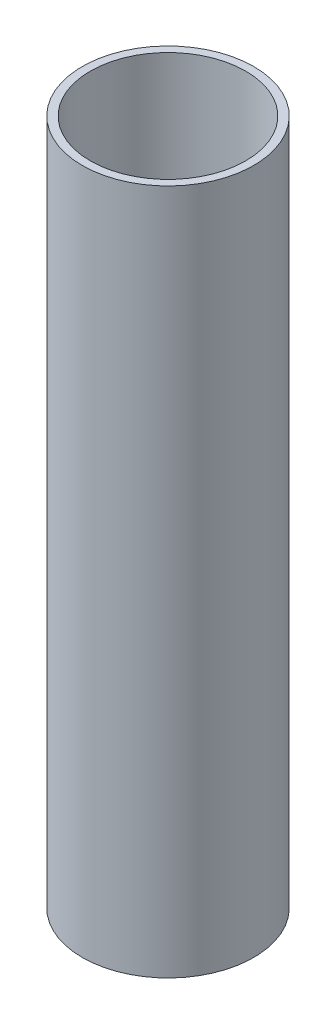
ISO-10303-21;
HEADER;
FILE_DESCRIPTION(('STEP AP214'),'2;1');
FILE_NAME('part.step','',(''),(''),'','','');
FILE_SCHEMA(('AUTOMOTIVE_DESIGN { 1 0 10303 214 1 1 1 1 }'));
ENDSEC;
DATA;
#1=APPLICATION_CONTEXT('core data for automotive mechanical design processes');
#2=APPLICATION_PROTOCOL_DEFINITION('international standard','automotive_design',2000,#1);
#3=PRODUCT_CONTEXT('',#1,'mechanical');
#4=PRODUCT('Part','Part','',(#3));
#5=PRODUCT_RELATED_PRODUCT_CATEGORY('part','',(#4));
#6=PRODUCT_DEFINITION_FORMATION('','',#4);
#7=PRODUCT_DEFINITION_CONTEXT('part definition',#1,'design');
#8=PRODUCT_DEFINITION('design','',#6,#7);
#9=PRODUCT_DEFINITION_SHAPE('','',#8);
#10=(LENGTH_UNIT() NAMED_UNIT(*) SI_UNIT(.MILLI.,.METRE.));
#11=(NAMED_UNIT(*) PLANE_ANGLE_UNIT() SI_UNIT($,.RADIAN.));
#12=(NAMED_UNIT(*) SI_UNIT($,.STERADIAN.) SOLID_ANGLE_UNIT());
#13=UNCERTAINTY_MEASURE_WITH_UNIT(LENGTH_MEASURE(1.E-05),#10,'distance_accuracy_value','');
#14=(GEOMETRIC_REPRESENTATION_CONTEXT(3) GLOBAL_UNCERTAINTY_ASSIGNED_CONTEXT((#13)) GLOBAL_UNIT_ASSIGNED_CONTEXT((#10,
#11,#12)) REPRESENTATION_CONTEXT('',''));
#15=CARTESIAN_POINT('',(0.,0.,0.));
#16=DIRECTION('',(0.,0.,1.));
#17=DIRECTION('',(1.,0.,0.));
#18=AXIS2_PLACEMENT_3D('',#15,#16,#17);
#19=CARTESIAN_POINT('',(0.,38.1,0.));
#20=DIRECTION('',(0.,1.,0.));
#21=DIRECTION('',(0.,0.,1.));
#22=AXIS2_PLACEMENT_3D('',#19,#20,#21);
#23=PLANE('',#22);
#24=CARTESIAN_POINT('',(0.,38.1,0.));
#25=DIRECTION('',(0.,1.,0.));
#26=DIRECTION('',(0.,0.,1.));
#27=AXIS2_PLACEMENT_3D('',#24,#25,#26);
#28=CIRCLE('',#27,9.525);
#29=CARTESIAN_POINT('',(0.,38.1,9.525));
#30=VERTEX_POINT('',#29);
#31=EDGE_CURVE('E10',#30,#30,#28,.T.);
#32=ORIENTED_EDGE('',*,*,#31,.T.);
#33=EDGE_LOOP('',(#32));
#34=FACE_BOUND('',#33,.T.);
#35=CARTESIAN_POINT('',(0.,38.1,0.));
#36=DIRECTION('',(0.,1.,0.));
#37=DIRECTION('',(0.,0.,1.));
#38=AXIS2_PLACEMENT_3D('',#35,#36,#37);
#39=CIRCLE('',#38,8.636);
#40=CARTESIAN_POINT('',(0.,38.1,8.636));
#41=VERTEX_POINT('',#40);
#42=EDGE_CURVE('E42',#41,#41,#39,.T.);
#43=ORIENTED_EDGE('',*,*,#42,.F.);
#44=EDGE_LOOP('',(#43));
#45=FACE_BOUND('',#44,.T.);
#46=ADVANCED_FACE('F31',(#34,#45),#23,.T.);
#47=CARTESIAN_POINT('',(0.,-38.1,0.));
#48=DIRECTION('',(0.,1.,0.));
#49=DIRECTION('',(0.,0.,1.));
#50=AXIS2_PLACEMENT_3D('',#47,#48,#49);
#51=PLANE('',#50);
#52=CARTESIAN_POINT('',(0.,-38.1,0.));
#53=DIRECTION('',(0.,1.,0.));
#54=DIRECTION('',(0.,0.,1.));
#55=AXIS2_PLACEMENT_3D('',#52,#53,#54);
#56=CIRCLE('',#55,9.525);
#57=CARTESIAN_POINT('',(0.,-38.1,9.525));
#58=VERTEX_POINT('',#57);
#59=EDGE_CURVE('E35',#58,#58,#56,.T.);
#60=ORIENTED_EDGE('',*,*,#59,.F.);
#61=EDGE_LOOP('',(#60));
#62=FACE_BOUND('',#61,.T.);
#63=CARTESIAN_POINT('',(0.,-38.1,0.));
#64=DIRECTION('',(0.,1.,0.));
#65=DIRECTION('',(0.,0.,1.));
#66=AXIS2_PLACEMENT_3D('',#63,#64,#65);
#67=CIRCLE('',#66,8.636);
#68=CARTESIAN_POINT('',(0.,-38.1,8.636));
#69=VERTEX_POINT('',#68);
#70=EDGE_CURVE('E44',#69,#69,#67,.T.);
#71=ORIENTED_EDGE('',*,*,#70,.T.);
#72=EDGE_LOOP('',(#71));
#73=FACE_BOUND('',#72,.T.);
#74=ADVANCED_FACE('F54',(#62,#73),#51,.F.);
#75=CARTESIAN_POINT('',(0.,38.1,0.));
#76=DIRECTION('',(0.,-1.,0.));
#77=DIRECTION('',(0.,0.,-1.));
#78=AXIS2_PLACEMENT_3D('',#75,#76,#77);
#79=CYLINDRICAL_SURFACE('',#78,9.525);
#80=ORIENTED_EDGE('',*,*,#31,.F.);
#81=EDGE_LOOP('',(#80));
#82=FACE_BOUND('',#81,.T.);
#83=ORIENTED_EDGE('',*,*,#59,.T.);
#84=EDGE_LOOP('',(#83));
#85=FACE_BOUND('',#84,.T.);
#86=ADVANCED_FACE('F33',(#82,#85),#79,.T.);
#87=CARTESIAN_POINT('',(0.,38.1,0.));
#88=DIRECTION('',(0.,-1.,0.));
#89=DIRECTION('',(0.,0.,-1.));
#90=AXIS2_PLACEMENT_3D('',#87,#88,#89);
#91=CYLINDRICAL_SURFACE('',#90,8.636);
#92=ORIENTED_EDGE('',*,*,#42,.T.);
#93=EDGE_LOOP('',(#92));
#94=FACE_BOUND('',#93,.T.);
#95=ORIENTED_EDGE('',*,*,#70,.F.);
#96=EDGE_LOOP('',(#95));
#97=FACE_BOUND('',#96,.T.);
#98=ADVANCED_FACE('F50',(#94,#97),#91,.F.);
#99=CLOSED_SHELL('',(#46,#74,#86,#98));
#100=MANIFOLD_SOLID_BREP('B2',#99);
#101=ADVANCED_BREP_SHAPE_REPRESENTATION('',(#18,#100),#14);
#102=SHAPE_DEFINITION_REPRESENTATION(#9,#101);
ENDSEC;
END-ISO-10303-21;
